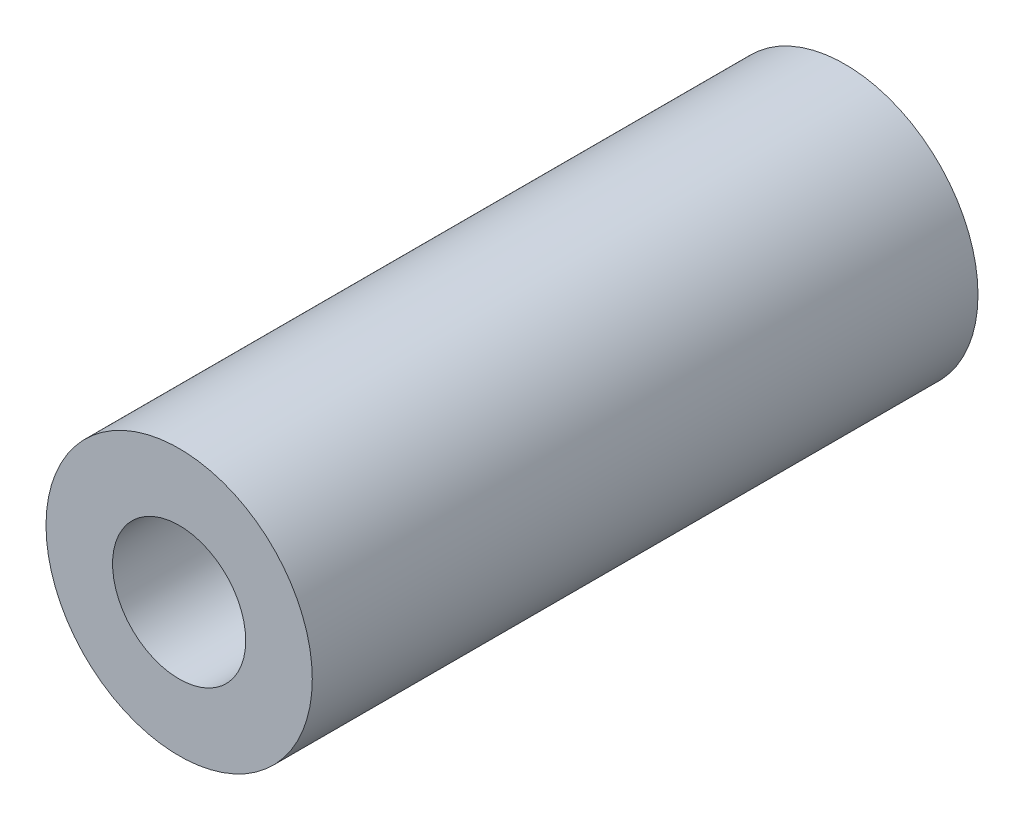
ISO-10303-21;
HEADER;
FILE_DESCRIPTION(('STEP AP214'),'2;1');
FILE_NAME('part.step','',(''),(''),'','','');
FILE_SCHEMA(('AUTOMOTIVE_DESIGN { 1 0 10303 214 1 1 1 1 }'));
ENDSEC;
DATA;
#1=APPLICATION_CONTEXT('core data for automotive mechanical design processes');
#2=APPLICATION_PROTOCOL_DEFINITION('international standard','automotive_design',2000,#1);
#3=PRODUCT_CONTEXT('',#1,'mechanical');
#4=PRODUCT('Part','Part','',(#3));
#5=PRODUCT_RELATED_PRODUCT_CATEGORY('part','',(#4));
#6=PRODUCT_DEFINITION_FORMATION('','',#4);
#7=PRODUCT_DEFINITION_CONTEXT('part definition',#1,'design');
#8=PRODUCT_DEFINITION('design','',#6,#7);
#9=PRODUCT_DEFINITION_SHAPE('','',#8);
#10=(LENGTH_UNIT() NAMED_UNIT(*) SI_UNIT(.MILLI.,.METRE.));
#11=(NAMED_UNIT(*) PLANE_ANGLE_UNIT() SI_UNIT($,.RADIAN.));
#12=(NAMED_UNIT(*) SI_UNIT($,.STERADIAN.) SOLID_ANGLE_UNIT());
#13=UNCERTAINTY_MEASURE_WITH_UNIT(LENGTH_MEASURE(1.E-05),#10,'distance_accuracy_value','');
#14=(GEOMETRIC_REPRESENTATION_CONTEXT(3) GLOBAL_UNCERTAINTY_ASSIGNED_CONTEXT((#13)) GLOBAL_UNIT_ASSIGNED_CONTEXT((#10,
#11,#12)) REPRESENTATION_CONTEXT('',''));
#15=CARTESIAN_POINT('',(0.,0.,0.));
#16=DIRECTION('',(0.,0.,1.));
#17=DIRECTION('',(1.,0.,0.));
#18=AXIS2_PLACEMENT_3D('',#15,#16,#17);
#19=CARTESIAN_POINT('',(0.,0.,10.));
#20=DIRECTION('',(0.,0.,1.));
#21=DIRECTION('',(1.,0.,0.));
#22=AXIS2_PLACEMENT_3D('',#19,#20,#21);
#23=PLANE('',#22);
#24=CARTESIAN_POINT('',(0.,0.,10.));
#25=DIRECTION('',(0.,0.,1.));
#26=DIRECTION('',(1.,0.,0.));
#27=AXIS2_PLACEMENT_3D('',#24,#25,#26);
#28=CIRCLE('',#27,4.);
#29=CARTESIAN_POINT('',(4.,0.,10.));
#30=VERTEX_POINT('',#29);
#31=EDGE_CURVE('E10',#30,#30,#28,.T.);
#32=ORIENTED_EDGE('',*,*,#31,.T.);
#33=EDGE_LOOP('',(#32));
#34=FACE_BOUND('',#33,.T.);
#35=CARTESIAN_POINT('',(0.,0.,10.));
#36=DIRECTION('',(0.,0.,1.));
#37=DIRECTION('',(1.,0.,0.));
#38=AXIS2_PLACEMENT_3D('',#35,#36,#37);
#39=CIRCLE('',#38,2.);
#40=CARTESIAN_POINT('',(2.,0.,10.));
#41=VERTEX_POINT('',#40);
#42=EDGE_CURVE('E41',#41,#41,#39,.T.);
#43=ORIENTED_EDGE('',*,*,#42,.F.);
#44=EDGE_LOOP('',(#43));
#45=FACE_BOUND('',#44,.T.);
#46=ADVANCED_FACE('F30',(#34,#45),#23,.T.);
#47=CARTESIAN_POINT('',(0.,0.,-10.));
#48=DIRECTION('',(0.,0.,1.));
#49=DIRECTION('',(1.,0.,0.));
#50=AXIS2_PLACEMENT_3D('',#47,#48,#49);
#51=PLANE('',#50);
#52=CARTESIAN_POINT('',(0.,0.,-10.));
#53=DIRECTION('',(0.,0.,1.));
#54=DIRECTION('',(1.,0.,0.));
#55=AXIS2_PLACEMENT_3D('',#52,#53,#54);
#56=CIRCLE('',#55,4.);
#57=CARTESIAN_POINT('',(4.,0.,-10.));
#58=VERTEX_POINT('',#57);
#59=EDGE_CURVE('E34',#58,#58,#56,.T.);
#60=ORIENTED_EDGE('',*,*,#59,.F.);
#61=EDGE_LOOP('',(#60));
#62=FACE_BOUND('',#61,.T.);
#63=CARTESIAN_POINT('',(0.,0.,-10.));
#64=DIRECTION('',(0.,0.,1.));
#65=DIRECTION('',(1.,0.,0.));
#66=AXIS2_PLACEMENT_3D('',#63,#64,#65);
#67=CIRCLE('',#66,2.);
#68=CARTESIAN_POINT('',(2.,0.,-10.));
#69=VERTEX_POINT('',#68);
#70=EDGE_CURVE('E43',#69,#69,#67,.T.);
#71=ORIENTED_EDGE('',*,*,#70,.T.);
#72=EDGE_LOOP('',(#71));
#73=FACE_BOUND('',#72,.T.);
#74=ADVANCED_FACE('F53',(#62,#73),#51,.F.);
#75=CARTESIAN_POINT('',(0.,0.,10.));
#76=DIRECTION('',(0.,0.,-1.));
#77=DIRECTION('',(-1.,0.,0.));
#78=AXIS2_PLACEMENT_3D('',#75,#76,#77);
#79=CYLINDRICAL_SURFACE('',#78,4.);
#80=ORIENTED_EDGE('',*,*,#31,.F.);
#81=EDGE_LOOP('',(#80));
#82=FACE_BOUND('',#81,.T.);
#83=ORIENTED_EDGE('',*,*,#59,.T.);
#84=EDGE_LOOP('',(#83));
#85=FACE_BOUND('',#84,.T.);
#86=ADVANCED_FACE('F32',(#82,#85),#79,.T.);
#87=CARTESIAN_POINT('',(0.,0.,10.));
#88=DIRECTION('',(0.,0.,-1.));
#89=DIRECTION('',(-1.,0.,0.));
#90=AXIS2_PLACEMENT_3D('',#87,#88,#89);
#91=CYLINDRICAL_SURFACE('',#90,2.);
#92=ORIENTED_EDGE('',*,*,#42,.T.);
#93=EDGE_LOOP('',(#92));
#94=FACE_BOUND('',#93,.T.);
#95=ORIENTED_EDGE('',*,*,#70,.F.);
#96=EDGE_LOOP('',(#95));
#97=FACE_BOUND('',#96,.T.);
#98=ADVANCED_FACE('F49',(#94,#97),#91,.F.);
#99=CLOSED_SHELL('',(#46,#74,#86,#98));
#100=MANIFOLD_SOLID_BREP('B2',#99);
#101=ADVANCED_BREP_SHAPE_REPRESENTATION('',(#18,#100),#14);
#102=SHAPE_DEFINITION_REPRESENTATION(#9,#101);
ENDSEC;
END-ISO-10303-21;
